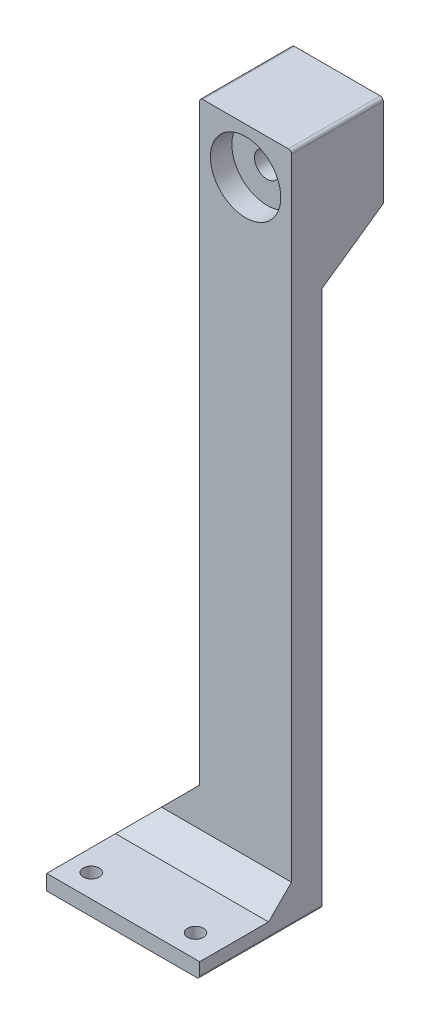
ISO-10303-21;
HEADER;
FILE_DESCRIPTION(('STEP AP214'),'2;1');
FILE_NAME('part.step','',(''),(''),'','','');
FILE_SCHEMA(('AUTOMOTIVE_DESIGN { 1 0 10303 214 1 1 1 1 }'));
ENDSEC;
DATA;
#1=APPLICATION_CONTEXT('core data for automotive mechanical design processes');
#2=APPLICATION_PROTOCOL_DEFINITION('international standard','automotive_design',2000,#1);
#3=PRODUCT_CONTEXT('',#1,'mechanical');
#4=PRODUCT('Part','Part','',(#3));
#5=PRODUCT_RELATED_PRODUCT_CATEGORY('part','',(#4));
#6=PRODUCT_DEFINITION_FORMATION('','',#4);
#7=PRODUCT_DEFINITION_CONTEXT('part definition',#1,'design');
#8=PRODUCT_DEFINITION('design','',#6,#7);
#9=PRODUCT_DEFINITION_SHAPE('','',#8);
#10=(LENGTH_UNIT() NAMED_UNIT(*) SI_UNIT(.MILLI.,.METRE.));
#11=(NAMED_UNIT(*) PLANE_ANGLE_UNIT() SI_UNIT($,.RADIAN.));
#12=(NAMED_UNIT(*) SI_UNIT($,.STERADIAN.) SOLID_ANGLE_UNIT());
#13=UNCERTAINTY_MEASURE_WITH_UNIT(LENGTH_MEASURE(1.E-05),#10,'distance_accuracy_value','');
#14=(GEOMETRIC_REPRESENTATION_CONTEXT(3) GLOBAL_UNCERTAINTY_ASSIGNED_CONTEXT((#13)) GLOBAL_UNIT_ASSIGNED_CONTEXT((#10,
#11,#12)) REPRESENTATION_CONTEXT('',''));
#15=CARTESIAN_POINT('',(0.,0.,0.));
#16=DIRECTION('',(0.,0.,1.));
#17=DIRECTION('',(1.,0.,0.));
#18=AXIS2_PLACEMENT_3D('',#15,#16,#17);
#19=CARTESIAN_POINT('',(0.,0.,-13.));
#20=DIRECTION('',(0.,0.,-1.));
#21=DIRECTION('',(-1.,0.,0.));
#22=AXIS2_PLACEMENT_3D('',#19,#20,#21);
#23=PLANE('',#22);
#24=CARTESIAN_POINT('',(522.434015224389,204.575071585759,-13.));
#25=DIRECTION('',(0.,0.,-1.));
#26=DIRECTION('',(-1.,0.,0.));
#27=AXIS2_PLACEMENT_3D('',#24,#25,#26);
#28=CIRCLE('',#27,4.10000000000005);
#29=CARTESIAN_POINT('',(518.334015224389,204.575071585759,-13.));
#30=VERTEX_POINT('',#29);
#31=EDGE_CURVE('E171',#30,#30,#28,.T.);
#32=ORIENTED_EDGE('',*,*,#31,.F.);
#33=EDGE_LOOP('',(#32));
#34=FACE_BOUND('',#33,.T.);
#35=CARTESIAN_POINT('',(522.434015224389,204.575071585759,-13.));
#36=DIRECTION('',(0.,0.,-1.));
#37=DIRECTION('',(-1.,0.,0.));
#38=AXIS2_PLACEMENT_3D('',#35,#36,#37);
#39=CIRCLE('',#38,11.4);
#40=CARTESIAN_POINT('',(511.034015224389,204.575071585759,-13.));
#41=VERTEX_POINT('',#40);
#42=EDGE_CURVE('E246',#41,#41,#39,.F.);
#43=ORIENTED_EDGE('',*,*,#42,.F.);
#44=EDGE_LOOP('',(#43));
#45=FACE_BOUND('',#44,.T.);
#46=ADVANCED_FACE('F37',(#34,#45),#23,.T.);
#47=CARTESIAN_POINT('',(0.,0.,0.));
#48=DIRECTION('',(0.,0.,1.));
#49=DIRECTION('',(1.,0.,0.));
#50=AXIS2_PLACEMENT_3D('',#47,#48,#49);
#51=PLANE('',#50);
#52=DIRECTION('',(0.,1.,0.));
#53=VECTOR('',#52,1.);
#54=CARTESIAN_POINT('',(537.434015224388,195.609984423857,0.));
#55=LINE('',#54,#53);
#56=CARTESIAN_POINT('',(537.434015224388,1.,0.));
#57=VERTEX_POINT('',#56);
#58=CARTESIAN_POINT('',(537.434015224388,175.570920821565,0.));
#59=VERTEX_POINT('',#58);
#60=EDGE_CURVE('E156',#57,#59,#55,.T.);
#61=ORIENTED_EDGE('',*,*,#60,.F.);
#62=CARTESIAN_POINT('',(536.434015224388,1.,0.));
#63=DIRECTION('',(0.,0.,1.));
#64=DIRECTION('',(1.,0.,0.));
#65=AXIS2_PLACEMENT_3D('',#62,#63,#64);
#66=CIRCLE('',#65,1.);
#67=CARTESIAN_POINT('',(536.434015224388,0.,0.));
#68=VERTEX_POINT('',#67);
#69=EDGE_CURVE('E257',#57,#68,#66,.F.);
#70=ORIENTED_EDGE('',*,*,#69,.T.);
#71=DIRECTION('',(1.,0.,0.));
#72=VECTOR('',#71,1.);
#73=CARTESIAN_POINT('',(507.43401522439,0.,0.));
#74=LINE('',#73,#72);
#75=CARTESIAN_POINT('',(487.43401522439,0.,0.));
#76=VERTEX_POINT('',#75);
#77=EDGE_CURVE('E225',#76,#68,#74,.T.);
#78=ORIENTED_EDGE('',*,*,#77,.F.);
#79=DIRECTION('',(0.,-1.,0.));
#80=VECTOR('',#79,1.);
#81=CARTESIAN_POINT('',(487.43401522439,0.,0.));
#82=LINE('',#81,#80);
#83=CARTESIAN_POINT('',(487.43401522439,5.,0.));
#84=VERTEX_POINT('',#83);
#85=EDGE_CURVE('E204',#84,#76,#82,.T.);
#86=ORIENTED_EDGE('',*,*,#85,.F.);
#87=DIRECTION('',(0.707106781186542,0.707106781186553,0.));
#88=VECTOR('',#87,1.);
#89=CARTESIAN_POINT('',(241.217007612199,-241.217007612195,0.));
#90=LINE('',#89,#88);
#91=CARTESIAN_POINT('',(507.43401522439,24.9999999999999,0.));
#92=VERTEX_POINT('',#91);
#93=EDGE_CURVE('E234',#84,#92,#90,.T.);
#94=ORIENTED_EDGE('',*,*,#93,.T.);
#95=DIRECTION('',(0.,-1.,0.));
#96=VECTOR('',#95,1.);
#97=CARTESIAN_POINT('',(507.434015224387,184.69087739587,0.));
#98=LINE('',#97,#96);
#99=CARTESIAN_POINT('',(507.434015224388,175.570920821565,0.));
#100=VERTEX_POINT('',#99);
#101=EDGE_CURVE('E210',#100,#92,#98,.T.);
#102=ORIENTED_EDGE('',*,*,#101,.F.);
#103=DIRECTION('',(1.,0.,0.));
#104=VECTOR('',#103,1.);
#105=CARTESIAN_POINT('',(537.434015224388,175.570920821565,0.));
#106=LINE('',#105,#104);
#107=EDGE_CURVE('E251',#100,#59,#106,.T.);
#108=ORIENTED_EDGE('',*,*,#107,.T.);
#109=EDGE_LOOP('',(#61,#70,#78,#86,#94,#102,#108));
#110=FACE_BOUND('',#109,.T.);
#111=ADVANCED_FACE('F307',(#110),#51,.F.);
#112=CARTESIAN_POINT('',(522.434015224389,204.575071585759,10.));
#113=DIRECTION('',(0.,0.,-1.));
#114=DIRECTION('',(-1.,0.,0.));
#115=AXIS2_PLACEMENT_3D('',#112,#113,#114);
#116=CYLINDRICAL_SURFACE('',#115,4.10000000000004);
#117=CARTESIAN_POINT('',(522.434015224389,204.575071585759,3.));
#118=DIRECTION('',(0.,0.,1.));
#119=DIRECTION('',(1.,0.,0.));
#120=AXIS2_PLACEMENT_3D('',#117,#118,#119);
#121=CIRCLE('',#120,4.10000000000004);
#122=CARTESIAN_POINT('',(526.534015224389,204.575071585759,3.));
#123=VERTEX_POINT('',#122);
#124=EDGE_CURVE('E178',#123,#123,#121,.T.);
#125=ORIENTED_EDGE('',*,*,#124,.T.);
#126=EDGE_LOOP('',(#125));
#127=FACE_BOUND('',#126,.T.);
#128=ORIENTED_EDGE('',*,*,#31,.T.);
#129=EDGE_LOOP('',(#128));
#130=FACE_BOUND('',#129,.T.);
#131=ADVANCED_FACE('F323',(#127,#130),#116,.F.);
#132=CARTESIAN_POINT('',(0.,0.,10.));
#133=DIRECTION('',(0.,0.,1.));
#134=DIRECTION('',(1.,0.,0.));
#135=AXIS2_PLACEMENT_3D('',#132,#133,#134);
#136=PLANE('',#135);
#137=CARTESIAN_POINT('',(522.434015224389,204.575071585759,10.));
#138=DIRECTION('',(0.,0.,1.));
#139=DIRECTION('',(1.,0.,0.));
#140=AXIS2_PLACEMENT_3D('',#137,#138,#139);
#141=CIRCLE('',#140,11.4999999999999);
#142=CARTESIAN_POINT('',(533.934015224389,204.575071585759,10.));
#143=VERTEX_POINT('',#142);
#144=EDGE_CURVE('E174',#143,#143,#141,.T.);
#145=ORIENTED_EDGE('',*,*,#144,.F.);
#146=EDGE_LOOP('',(#145));
#147=FACE_BOUND('',#146,.T.);
#148=DIRECTION('',(0.,1.,0.));
#149=VECTOR('',#148,1.);
#150=CARTESIAN_POINT('',(537.434015224388,195.609984423857,10.));
#151=LINE('',#150,#149);
#152=CARTESIAN_POINT('',(537.434015224388,12.5,10.));
#153=VERTEX_POINT('',#152);
#154=CARTESIAN_POINT('',(537.434015224388,218.57507158576,10.));
#155=VERTEX_POINT('',#154);
#156=EDGE_CURVE('E216',#153,#155,#151,.T.);
#157=ORIENTED_EDGE('',*,*,#156,.T.);
#158=CARTESIAN_POINT('',(536.434015224388,218.57507158576,10.));
#159=DIRECTION('',(0.,0.,1.));
#160=DIRECTION('',(1.,0.,0.));
#161=AXIS2_PLACEMENT_3D('',#158,#159,#160);
#162=CIRCLE('',#161,1.);
#163=CARTESIAN_POINT('',(536.434015224388,219.57507158576,10.));
#164=VERTEX_POINT('',#163);
#165=EDGE_CURVE('E45',#155,#164,#162,.T.);
#166=ORIENTED_EDGE('',*,*,#165,.T.);
#167=DIRECTION('',(-1.,0.,0.));
#168=VECTOR('',#167,1.);
#169=CARTESIAN_POINT('',(537.434015224388,219.57507158576,10.));
#170=LINE('',#169,#168);
#171=CARTESIAN_POINT('',(508.434015224387,219.57507158576,10.));
#172=VERTEX_POINT('',#171);
#173=EDGE_CURVE('E219',#164,#172,#170,.T.);
#174=ORIENTED_EDGE('',*,*,#173,.T.);
#175=CARTESIAN_POINT('',(508.434015224387,218.57507158576,10.));
#176=DIRECTION('',(0.,0.,1.));
#177=DIRECTION('',(1.,0.,0.));
#178=AXIS2_PLACEMENT_3D('',#175,#176,#177);
#179=CIRCLE('',#178,1.);
#180=CARTESIAN_POINT('',(507.434015224387,218.57507158576,10.));
#181=VERTEX_POINT('',#180);
#182=EDGE_CURVE('E52',#172,#181,#179,.T.);
#183=ORIENTED_EDGE('',*,*,#182,.T.);
#184=DIRECTION('',(0.,-1.,0.));
#185=VECTOR('',#184,1.);
#186=CARTESIAN_POINT('',(507.434015224387,219.57507158576,10.));
#187=LINE('',#186,#185);
#188=CARTESIAN_POINT('',(507.434015224387,24.9999999999999,10.));
#189=VERTEX_POINT('',#188);
#190=EDGE_CURVE('E221',#181,#189,#187,.T.);
#191=ORIENTED_EDGE('',*,*,#190,.T.);
#192=DIRECTION('',(-0.707106781186542,-0.707106781186553,0.));
#193=VECTOR('',#192,1.);
#194=CARTESIAN_POINT('',(507.43401522439,25.,10.));
#195=LINE('',#194,#193);
#196=CARTESIAN_POINT('',(494.93401522439,12.4999999999999,10.));
#197=VERTEX_POINT('',#196);
#198=EDGE_CURVE('E231',#189,#197,#195,.T.);
#199=ORIENTED_EDGE('',*,*,#198,.T.);
#200=DIRECTION('',(1.,0.,0.));
#201=VECTOR('',#200,1.);
#202=CARTESIAN_POINT('',(537.434015224388,12.5,10.));
#203=LINE('',#202,#201);
#204=EDGE_CURVE('E240',#197,#153,#203,.T.);
#205=ORIENTED_EDGE('',*,*,#204,.T.);
#206=EDGE_LOOP('',(#157,#166,#174,#183,#191,#199,#205));
#207=FACE_BOUND('',#206,.T.);
#208=ADVANCED_FACE('F272',(#147,#207),#136,.T.);
#209=CARTESIAN_POINT('',(537.434015224388,219.57507158576,10.));
#210=DIRECTION('',(0.,-1.,0.));
#211=DIRECTION('',(0.,0.,-1.));
#212=AXIS2_PLACEMENT_3D('',#209,#210,#211);
#213=PLANE('',#212);
#214=ORIENTED_EDGE('',*,*,#173,.F.);
#215=DIRECTION('',(0.,0.,-1.));
#216=VECTOR('',#215,1.);
#217=CARTESIAN_POINT('',(536.434015224388,219.57507158576,10.));
#218=LINE('',#217,#216);
#219=CARTESIAN_POINT('',(536.434015224388,219.57507158576,-20.));
#220=VERTEX_POINT('',#219);
#221=EDGE_CURVE('E265',#164,#220,#218,.T.);
#222=ORIENTED_EDGE('',*,*,#221,.T.);
#223=DIRECTION('',(1.,0.,0.));
#224=VECTOR('',#223,1.);
#225=CARTESIAN_POINT('',(537.434015224388,219.57507158576,-20.));
#226=LINE('',#225,#224);
#227=CARTESIAN_POINT('',(508.434015224387,219.57507158576,-20.));
#228=VERTEX_POINT('',#227);
#229=EDGE_CURVE('E166',#228,#220,#226,.T.);
#230=ORIENTED_EDGE('',*,*,#229,.F.);
#231=DIRECTION('',(0.,0.,-1.));
#232=VECTOR('',#231,1.);
#233=CARTESIAN_POINT('',(508.434015224387,219.57507158576,10.));
#234=LINE('',#233,#232);
#235=EDGE_CURVE('E263',#228,#172,#234,.F.);
#236=ORIENTED_EDGE('',*,*,#235,.T.);
#237=EDGE_LOOP('',(#214,#222,#230,#236));
#238=FACE_BOUND('',#237,.T.);
#239=ADVANCED_FACE('F277',(#238),#213,.F.);
#240=CARTESIAN_POINT('',(507.434015224387,184.69087739587,10.));
#241=DIRECTION('',(1.,0.,0.));
#242=DIRECTION('',(0.,1.,0.));
#243=AXIS2_PLACEMENT_3D('',#240,#241,#242);
#244=PLANE('',#243);
#245=ORIENTED_EDGE('',*,*,#190,.F.);
#246=DIRECTION('',(0.,0.,-1.));
#247=VECTOR('',#246,1.);
#248=CARTESIAN_POINT('',(507.434015224387,218.57507158576,10.));
#249=LINE('',#248,#247);
#250=CARTESIAN_POINT('',(507.434015224388,218.57507158576,-20.));
#251=VERTEX_POINT('',#250);
#252=EDGE_CURVE('E11',#181,#251,#249,.T.);
#253=ORIENTED_EDGE('',*,*,#252,.T.);
#254=DIRECTION('',(0.,1.,0.));
#255=VECTOR('',#254,1.);
#256=CARTESIAN_POINT('',(507.434015224388,219.57507158576,-20.));
#257=LINE('',#256,#255);
#258=CARTESIAN_POINT('',(507.434015224387,189.57507158576,-20.));
#259=VERTEX_POINT('',#258);
#260=EDGE_CURVE('E164',#259,#251,#257,.T.);
#261=ORIENTED_EDGE('',*,*,#260,.F.);
#262=DIRECTION('',(0.,0.573576436351051,-0.819152044288989));
#263=VECTOR('',#262,1.);
#264=CARTESIAN_POINT('',(507.434015224388,173.872831577454,2.42512276924731));
#265=LINE('',#264,#263);
#266=EDGE_CURVE('E161',#259,#100,#265,.F.);
#267=ORIENTED_EDGE('',*,*,#266,.T.);
#268=ORIENTED_EDGE('',*,*,#101,.T.);
#269=DIRECTION('',(0.,0.,1.));
#270=VECTOR('',#269,1.);
#271=CARTESIAN_POINT('',(507.43401522439,24.9999999999999,10.));
#272=LINE('',#271,#270);
#273=EDGE_CURVE('E223',#92,#189,#272,.T.);
#274=ORIENTED_EDGE('',*,*,#273,.T.);
#275=EDGE_LOOP('',(#245,#253,#261,#267,#268,#274));
#276=FACE_BOUND('',#275,.T.);
#277=ADVANCED_FACE('F312',(#276),#244,.F.);
#278=CARTESIAN_POINT('',(507.43401522439,0.,10.));
#279=DIRECTION('',(0.,1.,0.));
#280=DIRECTION('',(-1.,0.,0.));
#281=AXIS2_PLACEMENT_3D('',#278,#279,#280);
#282=PLANE('',#281);
#283=CARTESIAN_POINT('',(528.574793847968,0.,32.5));
#284=DIRECTION('',(0.,1.,0.));
#285=DIRECTION('',(-1.,0.,0.));
#286=AXIS2_PLACEMENT_3D('',#283,#284,#285);
#287=CIRCLE('',#286,2.60000000000007);
#288=CARTESIAN_POINT('',(525.974793847968,0.,32.5));
#289=VERTEX_POINT('',#288);
#290=EDGE_CURVE('E190',#289,#289,#287,.T.);
#291=ORIENTED_EDGE('',*,*,#290,.T.);
#292=EDGE_LOOP('',(#291));
#293=FACE_BOUND('',#292,.T.);
#294=CARTESIAN_POINT('',(494.48401522439,0.,32.5));
#295=DIRECTION('',(0.,1.,0.));
#296=DIRECTION('',(-1.,0.,0.));
#297=AXIS2_PLACEMENT_3D('',#294,#295,#296);
#298=CIRCLE('',#297,2.60000000000002);
#299=CARTESIAN_POINT('',(491.88401522439,0.,32.5));
#300=VERTEX_POINT('',#299);
#301=EDGE_CURVE('E184',#300,#300,#298,.T.);
#302=ORIENTED_EDGE('',*,*,#301,.T.);
#303=EDGE_LOOP('',(#302));
#304=FACE_BOUND('',#303,.T.);
#305=ORIENTED_EDGE('',*,*,#77,.T.);
#306=DIRECTION('',(0.,0.,-1.));
#307=VECTOR('',#306,1.);
#308=CARTESIAN_POINT('',(536.434015224388,0.,10.));
#309=LINE('',#308,#307);
#310=CARTESIAN_POINT('',(536.434015224388,0.,40.));
#311=VERTEX_POINT('',#310);
#312=EDGE_CURVE('E259',#68,#311,#309,.F.);
#313=ORIENTED_EDGE('',*,*,#312,.T.);
#314=DIRECTION('',(1.,0.,0.));
#315=VECTOR('',#314,1.);
#316=CARTESIAN_POINT('',(507.43401522439,0.,40.));
#317=LINE('',#316,#315);
#318=CARTESIAN_POINT('',(487.43401522439,0.,40.));
#319=VERTEX_POINT('',#318);
#320=EDGE_CURVE('E193',#319,#311,#317,.T.);
#321=ORIENTED_EDGE('',*,*,#320,.F.);
#322=DIRECTION('',(0.,0.,1.));
#323=VECTOR('',#322,1.);
#324=CARTESIAN_POINT('',(487.43401522439,0.,0.));
#325=LINE('',#324,#323);
#326=EDGE_CURVE('E208',#76,#319,#325,.T.);
#327=ORIENTED_EDGE('',*,*,#326,.F.);
#328=EDGE_LOOP('',(#305,#313,#321,#327));
#329=FACE_BOUND('',#328,.T.);
#330=ADVANCED_FACE('F301',(#293,#304,#329),#282,.F.);
#331=CARTESIAN_POINT('',(537.434015224388,195.609984423857,10.));
#332=DIRECTION('',(-1.,0.,0.));
#333=DIRECTION('',(0.,-1.,0.));
#334=AXIS2_PLACEMENT_3D('',#331,#332,#333);
#335=PLANE('',#334);
#336=DIRECTION('',(0.,1.,0.));
#337=VECTOR('',#336,1.);
#338=CARTESIAN_POINT('',(537.434015224388,0.,40.));
#339=LINE('',#338,#337);
#340=CARTESIAN_POINT('',(537.434015224388,1.,40.));
#341=VERTEX_POINT('',#340);
#342=CARTESIAN_POINT('',(537.434015224388,5.,40.));
#343=VERTEX_POINT('',#342);
#344=EDGE_CURVE('E196',#341,#343,#339,.T.);
#345=ORIENTED_EDGE('',*,*,#344,.F.);
#346=DIRECTION('',(0.,0.,-1.));
#347=VECTOR('',#346,1.);
#348=CARTESIAN_POINT('',(537.434015224388,1.,10.));
#349=LINE('',#348,#347);
#350=EDGE_CURVE('E255',#341,#57,#349,.T.);
#351=ORIENTED_EDGE('',*,*,#350,.T.);
#352=ORIENTED_EDGE('',*,*,#60,.T.);
#353=DIRECTION('',(0.,-0.573576436351051,0.819152044288989));
#354=VECTOR('',#353,1.);
#355=CARTESIAN_POINT('',(537.434015224388,177.465107816098,-2.70517938063804));
#356=LINE('',#355,#354);
#357=CARTESIAN_POINT('',(537.434015224388,189.57507158576,-20.));
#358=VERTEX_POINT('',#357);
#359=EDGE_CURVE('E151',#59,#358,#356,.F.);
#360=ORIENTED_EDGE('',*,*,#359,.T.);
#361=DIRECTION('',(0.,-1.,0.));
#362=VECTOR('',#361,1.);
#363=CARTESIAN_POINT('',(537.434015224388,219.57507158576,-20.));
#364=LINE('',#363,#362);
#365=CARTESIAN_POINT('',(537.434015224388,218.57507158576,-20.));
#366=VERTEX_POINT('',#365);
#367=EDGE_CURVE('E136',#366,#358,#364,.T.);
#368=ORIENTED_EDGE('',*,*,#367,.F.);
#369=DIRECTION('',(0.,0.,-1.));
#370=VECTOR('',#369,1.);
#371=CARTESIAN_POINT('',(537.434015224388,218.57507158576,10.));
#372=LINE('',#371,#370);
#373=EDGE_CURVE('E160',#366,#155,#372,.F.);
#374=ORIENTED_EDGE('',*,*,#373,.T.);
#375=ORIENTED_EDGE('',*,*,#156,.F.);
#376=DIRECTION('',(0.,0.707106781186544,-0.707106781186552));
#377=VECTOR('',#376,1.);
#378=CARTESIAN_POINT('',(537.434015224388,104.054992211927,-81.5549922119284));
#379=LINE('',#378,#377);
#380=CARTESIAN_POINT('',(537.434015224388,5.,17.5));
#381=VERTEX_POINT('',#380);
#382=EDGE_CURVE('E244',#153,#381,#379,.F.);
#383=ORIENTED_EDGE('',*,*,#382,.T.);
#384=DIRECTION('',(0.,0.,1.));
#385=VECTOR('',#384,1.);
#386=CARTESIAN_POINT('',(537.434015224388,5.,0.));
#387=LINE('',#386,#385);
#388=EDGE_CURVE('E207',#381,#343,#387,.T.);
#389=ORIENTED_EDGE('',*,*,#388,.T.);
#390=EDGE_LOOP('',(#345,#351,#352,#360,#368,#374,#375,#383,#389));
#391=FACE_BOUND('',#390,.T.);
#392=ADVANCED_FACE('F153',(#391),#335,.F.);
#393=CARTESIAN_POINT('',(487.43401522439,0.,0.));
#394=DIRECTION('',(-1.,0.,0.));
#395=DIRECTION('',(0.,0.,1.));
#396=AXIS2_PLACEMENT_3D('',#393,#394,#395);
#397=PLANE('',#396);
#398=ORIENTED_EDGE('',*,*,#326,.T.);
#399=DIRECTION('',(0.,-1.,0.));
#400=VECTOR('',#399,1.);
#401=CARTESIAN_POINT('',(487.43401522439,0.,40.));
#402=LINE('',#401,#400);
#403=CARTESIAN_POINT('',(487.43401522439,5.,40.));
#404=VERTEX_POINT('',#403);
#405=EDGE_CURVE('E201',#404,#319,#402,.T.);
#406=ORIENTED_EDGE('',*,*,#405,.F.);
#407=DIRECTION('',(0.,0.,1.));
#408=VECTOR('',#407,1.);
#409=CARTESIAN_POINT('',(487.43401522439,5.,0.));
#410=LINE('',#409,#408);
#411=CARTESIAN_POINT('',(487.43401522439,5.,17.5));
#412=VERTEX_POINT('',#411);
#413=EDGE_CURVE('E213',#412,#404,#410,.T.);
#414=ORIENTED_EDGE('',*,*,#413,.F.);
#415=EDGE_CURVE('E211',#84,#412,#410,.T.);
#416=ORIENTED_EDGE('',*,*,#415,.F.);
#417=ORIENTED_EDGE('',*,*,#85,.T.);
#418=EDGE_LOOP('',(#398,#406,#414,#416,#417));
#419=FACE_BOUND('',#418,.T.);
#420=ADVANCED_FACE('F293',(#419),#397,.T.);
#421=CARTESIAN_POINT('',(487.43401522439,5.,0.));
#422=DIRECTION('',(0.,1.,0.));
#423=DIRECTION('',(0.,0.,1.));
#424=AXIS2_PLACEMENT_3D('',#421,#422,#423);
#425=PLANE('',#424);
#426=CARTESIAN_POINT('',(528.574793847968,5.,32.5));
#427=DIRECTION('',(0.,1.,0.));
#428=DIRECTION('',(0.,0.,1.));
#429=AXIS2_PLACEMENT_3D('',#426,#427,#428);
#430=CIRCLE('',#429,2.60000000000007);
#431=CARTESIAN_POINT('',(528.574793847968,5.,35.1000000000001));
#432=VERTEX_POINT('',#431);
#433=EDGE_CURVE('E181',#432,#432,#430,.T.);
#434=ORIENTED_EDGE('',*,*,#433,.F.);
#435=EDGE_LOOP('',(#434));
#436=FACE_BOUND('',#435,.T.);
#437=CARTESIAN_POINT('',(494.48401522439,5.,32.5));
#438=DIRECTION('',(0.,1.,0.));
#439=DIRECTION('',(0.,0.,1.));
#440=AXIS2_PLACEMENT_3D('',#437,#438,#439);
#441=CIRCLE('',#440,2.60000000000002);
#442=CARTESIAN_POINT('',(494.48401522439,5.,35.1));
#443=VERTEX_POINT('',#442);
#444=EDGE_CURVE('E185',#443,#443,#441,.T.);
#445=ORIENTED_EDGE('',*,*,#444,.F.);
#446=EDGE_LOOP('',(#445));
#447=FACE_BOUND('',#446,.T.);
#448=ORIENTED_EDGE('',*,*,#388,.F.);
#449=DIRECTION('',(-1.,0.,0.));
#450=VECTOR('',#449,1.);
#451=CARTESIAN_POINT('',(487.43401522439,5.,17.5));
#452=LINE('',#451,#450);
#453=EDGE_CURVE('E237',#381,#412,#452,.T.);
#454=ORIENTED_EDGE('',*,*,#453,.T.);
#455=ORIENTED_EDGE('',*,*,#413,.T.);
#456=DIRECTION('',(-1.,0.,0.));
#457=VECTOR('',#456,1.);
#458=CARTESIAN_POINT('',(507.43401522439,5.,40.));
#459=LINE('',#458,#457);
#460=EDGE_CURVE('E198',#343,#404,#459,.T.);
#461=ORIENTED_EDGE('',*,*,#460,.F.);
#462=EDGE_LOOP('',(#448,#454,#455,#461));
#463=FACE_BOUND('',#462,.T.);
#464=ADVANCED_FACE('F289',(#436,#447,#463),#425,.T.);
#465=CARTESIAN_POINT('',(0.,0.,40.));
#466=DIRECTION('',(0.,0.,-1.));
#467=DIRECTION('',(-1.,0.,0.));
#468=AXIS2_PLACEMENT_3D('',#465,#466,#467);
#469=PLANE('',#468);
#470=ORIENTED_EDGE('',*,*,#320,.T.);
#471=CARTESIAN_POINT('',(536.434015224388,1.,40.));
#472=DIRECTION('',(0.,0.,-1.));
#473=DIRECTION('',(-1.,0.,0.));
#474=AXIS2_PLACEMENT_3D('',#471,#472,#473);
#475=CIRCLE('',#474,1.);
#476=EDGE_CURVE('E261',#311,#341,#475,.F.);
#477=ORIENTED_EDGE('',*,*,#476,.T.);
#478=ORIENTED_EDGE('',*,*,#344,.T.);
#479=ORIENTED_EDGE('',*,*,#460,.T.);
#480=ORIENTED_EDGE('',*,*,#405,.T.);
#481=EDGE_LOOP('',(#470,#477,#478,#479,#480));
#482=FACE_BOUND('',#481,.T.);
#483=ADVANCED_FACE('F298',(#482),#469,.F.);
#484=CARTESIAN_POINT('',(494.48401522439,-15.,32.5));
#485=DIRECTION('',(0.,1.,0.));
#486=DIRECTION('',(0.,0.,1.));
#487=AXIS2_PLACEMENT_3D('',#484,#485,#486);
#488=CYLINDRICAL_SURFACE('',#487,2.60000000000002);
#489=ORIENTED_EDGE('',*,*,#444,.T.);
#490=EDGE_LOOP('',(#489));
#491=FACE_BOUND('',#490,.T.);
#492=ORIENTED_EDGE('',*,*,#301,.F.);
#493=EDGE_LOOP('',(#492));
#494=FACE_BOUND('',#493,.T.);
#495=ADVANCED_FACE('F342',(#491,#494),#488,.F.);
#496=CARTESIAN_POINT('',(528.574793847968,-15.,32.5));
#497=DIRECTION('',(0.,1.,0.));
#498=DIRECTION('',(0.,0.,1.));
#499=AXIS2_PLACEMENT_3D('',#496,#497,#498);
#500=CYLINDRICAL_SURFACE('',#499,2.60000000000007);
#501=ORIENTED_EDGE('',*,*,#433,.T.);
#502=EDGE_LOOP('',(#501));
#503=FACE_BOUND('',#502,.T.);
#504=ORIENTED_EDGE('',*,*,#290,.F.);
#505=EDGE_LOOP('',(#504));
#506=FACE_BOUND('',#505,.T.);
#507=ADVANCED_FACE('F338',(#503,#506),#500,.F.);
#508=CARTESIAN_POINT('',(507.43401522439,25.,10.));
#509=DIRECTION('',(0.707106781186553,-0.707106781186542,0.));
#510=DIRECTION('',(0.,0.,1.));
#511=AXIS2_PLACEMENT_3D('',#508,#509,#510);
#512=PLANE('',#511);
#513=ORIENTED_EDGE('',*,*,#93,.F.);
#514=ORIENTED_EDGE('',*,*,#415,.T.);
#515=DIRECTION('',(-0.577350269189618,-0.577350269189626,0.577350269189633));
#516=VECTOR('',#515,1.);
#517=CARTESIAN_POINT('',(503.267348557723,20.8333333333332,1.66666666666667));
#518=LINE('',#517,#516);
#519=EDGE_CURVE('E242',#412,#197,#518,.F.);
#520=ORIENTED_EDGE('',*,*,#519,.T.);
#521=ORIENTED_EDGE('',*,*,#198,.F.);
#522=ORIENTED_EDGE('',*,*,#273,.F.);
#523=EDGE_LOOP('',(#513,#514,#520,#521,#522));
#524=FACE_BOUND('',#523,.T.);
#525=ADVANCED_FACE('F341',(#524),#512,.F.);
#526=CARTESIAN_POINT('',(487.43401522439,5.,17.5));
#527=DIRECTION('',(0.,0.707106781186552,0.707106781186544));
#528=DIRECTION('',(1.,0.,0.));
#529=AXIS2_PLACEMENT_3D('',#526,#527,#528);
#530=PLANE('',#529);
#531=ORIENTED_EDGE('',*,*,#382,.F.);
#532=ORIENTED_EDGE('',*,*,#204,.F.);
#533=ORIENTED_EDGE('',*,*,#519,.F.);
#534=ORIENTED_EDGE('',*,*,#453,.F.);
#535=EDGE_LOOP('',(#531,#532,#533,#534));
#536=FACE_BOUND('',#535,.T.);
#537=ADVANCED_FACE('F285',(#536),#530,.T.);
#538=CARTESIAN_POINT('',(522.434015224389,204.575071585759,3.));
#539=DIRECTION('',(0.,0.,1.));
#540=DIRECTION('',(1.,0.,0.));
#541=AXIS2_PLACEMENT_3D('',#538,#539,#540);
#542=CYLINDRICAL_SURFACE('',#541,11.4999999999999);
#543=CARTESIAN_POINT('',(522.434015224389,204.575071585759,3.));
#544=DIRECTION('',(0.,0.,1.));
#545=DIRECTION('',(1.,0.,0.));
#546=AXIS2_PLACEMENT_3D('',#543,#544,#545);
#547=CIRCLE('',#546,11.4999999999999);
#548=CARTESIAN_POINT('',(533.934015224389,204.575071585759,3.));
#549=VERTEX_POINT('',#548);
#550=EDGE_CURVE('E175',#549,#549,#547,.T.);
#551=ORIENTED_EDGE('',*,*,#550,.F.);
#552=EDGE_LOOP('',(#551));
#553=FACE_BOUND('',#552,.T.);
#554=ORIENTED_EDGE('',*,*,#144,.T.);
#555=EDGE_LOOP('',(#554));
#556=FACE_BOUND('',#555,.T.);
#557=ADVANCED_FACE('F333',(#553,#556),#542,.F.);
#558=CARTESIAN_POINT('',(522.434015224389,204.575071585759,3.));
#559=DIRECTION('',(0.,0.,1.));
#560=DIRECTION('',(1.,0.,0.));
#561=AXIS2_PLACEMENT_3D('',#558,#559,#560);
#562=PLANE('',#561);
#563=ORIENTED_EDGE('',*,*,#124,.F.);
#564=EDGE_LOOP('',(#563));
#565=FACE_BOUND('',#564,.T.);
#566=ORIENTED_EDGE('',*,*,#550,.T.);
#567=EDGE_LOOP('',(#566));
#568=FACE_BOUND('',#567,.T.);
#569=ADVANCED_FACE('F330',(#565,#568),#562,.T.);
#570=CARTESIAN_POINT('',(0.,0.,-20.));
#571=DIRECTION('',(0.,0.,-1.));
#572=DIRECTION('',(-1.,0.,0.));
#573=AXIS2_PLACEMENT_3D('',#570,#571,#572);
#574=PLANE('',#573);
#575=ORIENTED_EDGE('',*,*,#229,.T.);
#576=CARTESIAN_POINT('',(536.434015224388,218.57507158576,-20.));
#577=DIRECTION('',(0.,0.,-1.));
#578=DIRECTION('',(-1.,0.,0.));
#579=AXIS2_PLACEMENT_3D('',#576,#577,#578);
#580=CIRCLE('',#579,1.);
#581=EDGE_CURVE('E145',#220,#366,#580,.T.);
#582=ORIENTED_EDGE('',*,*,#581,.T.);
#583=ORIENTED_EDGE('',*,*,#367,.T.);
#584=DIRECTION('',(-1.,0.,0.));
#585=VECTOR('',#584,1.);
#586=CARTESIAN_POINT('',(537.434015224388,189.57507158576,-20.));
#587=LINE('',#586,#585);
#588=EDGE_CURVE('E143',#358,#259,#587,.T.);
#589=ORIENTED_EDGE('',*,*,#588,.T.);
#590=ORIENTED_EDGE('',*,*,#260,.T.);
#591=CARTESIAN_POINT('',(508.434015224387,218.57507158576,-20.));
#592=DIRECTION('',(0.,0.,-1.));
#593=DIRECTION('',(-1.,0.,0.));
#594=AXIS2_PLACEMENT_3D('',#591,#592,#593);
#595=CIRCLE('',#594,1.);
#596=EDGE_CURVE('E60',#251,#228,#595,.T.);
#597=ORIENTED_EDGE('',*,*,#596,.T.);
#598=EDGE_LOOP('',(#575,#582,#583,#589,#590,#597));
#599=FACE_BOUND('',#598,.T.);
#600=CARTESIAN_POINT('',(522.434015224389,204.575071585759,-20.));
#601=DIRECTION('',(0.,0.,-1.));
#602=DIRECTION('',(-1.,0.,0.));
#603=AXIS2_PLACEMENT_3D('',#600,#601,#602);
#604=CIRCLE('',#603,11.4);
#605=CARTESIAN_POINT('',(511.034015224389,204.575071585759,-20.));
#606=VERTEX_POINT('',#605);
#607=EDGE_CURVE('E148',#606,#606,#604,.T.);
#608=ORIENTED_EDGE('',*,*,#607,.F.);
#609=EDGE_LOOP('',(#608));
#610=FACE_BOUND('',#609,.T.);
#611=ADVANCED_FACE('F139',(#599,#610),#574,.T.);
#612=CARTESIAN_POINT('',(522.434015224389,204.575071585759,-20.));
#613=DIRECTION('',(0.,0.,1.));
#614=DIRECTION('',(1.,0.,0.));
#615=AXIS2_PLACEMENT_3D('',#612,#613,#614);
#616=CYLINDRICAL_SURFACE('',#615,11.4);
#617=ORIENTED_EDGE('',*,*,#607,.T.);
#618=EDGE_LOOP('',(#617));
#619=FACE_BOUND('',#618,.T.);
#620=ORIENTED_EDGE('',*,*,#42,.T.);
#621=EDGE_LOOP('',(#620));
#622=FACE_BOUND('',#621,.T.);
#623=ADVANCED_FACE('F385',(#619,#622),#616,.F.);
#624=CARTESIAN_POINT('',(537.434015224388,189.57507158576,-19.9999999999999));
#625=DIRECTION('',(0.,-0.819152044288989,-0.57357643635105));
#626=DIRECTION('',(1.,0.,0.));
#627=AXIS2_PLACEMENT_3D('',#624,#625,#626);
#628=PLANE('',#627);
#629=ORIENTED_EDGE('',*,*,#359,.F.);
#630=ORIENTED_EDGE('',*,*,#107,.F.);
#631=ORIENTED_EDGE('',*,*,#266,.F.);
#632=ORIENTED_EDGE('',*,*,#588,.F.);
#633=EDGE_LOOP('',(#629,#630,#631,#632));
#634=FACE_BOUND('',#633,.T.);
#635=ADVANCED_FACE('F163',(#634),#628,.T.);
#636=CARTESIAN_POINT('',(536.434015224388,1.,10.));
#637=DIRECTION('',(0.,0.,-1.));
#638=DIRECTION('',(-1.,0.,0.));
#639=AXIS2_PLACEMENT_3D('',#636,#637,#638);
#640=CYLINDRICAL_SURFACE('',#639,1.);
#641=ORIENTED_EDGE('',*,*,#476,.F.);
#642=ORIENTED_EDGE('',*,*,#312,.F.);
#643=ORIENTED_EDGE('',*,*,#69,.F.);
#644=ORIENTED_EDGE('',*,*,#350,.F.);
#645=EDGE_LOOP('',(#641,#642,#643,#644));
#646=FACE_BOUND('',#645,.T.);
#647=ADVANCED_FACE('F304',(#646),#640,.T.);
#648=CARTESIAN_POINT('',(536.434015224388,218.57507158576,10.));
#649=DIRECTION('',(0.,0.,-1.));
#650=DIRECTION('',(-1.,0.,0.));
#651=AXIS2_PLACEMENT_3D('',#648,#649,#650);
#652=CYLINDRICAL_SURFACE('',#651,1.);
#653=ORIENTED_EDGE('',*,*,#165,.F.);
#654=ORIENTED_EDGE('',*,*,#373,.F.);
#655=ORIENTED_EDGE('',*,*,#581,.F.);
#656=ORIENTED_EDGE('',*,*,#221,.F.);
#657=EDGE_LOOP('',(#653,#654,#655,#656));
#658=FACE_BOUND('',#657,.T.);
#659=ADVANCED_FACE('F279',(#658),#652,.T.);
#660=CARTESIAN_POINT('',(508.434015224387,218.57507158576,10.));
#661=DIRECTION('',(0.,0.,-1.));
#662=DIRECTION('',(-1.,0.,0.));
#663=AXIS2_PLACEMENT_3D('',#660,#661,#662);
#664=CYLINDRICAL_SURFACE('',#663,1.);
#665=ORIENTED_EDGE('',*,*,#182,.F.);
#666=ORIENTED_EDGE('',*,*,#235,.F.);
#667=ORIENTED_EDGE('',*,*,#596,.F.);
#668=ORIENTED_EDGE('',*,*,#252,.F.);
#669=EDGE_LOOP('',(#665,#666,#667,#668));
#670=FACE_BOUND('',#669,.T.);
#671=ADVANCED_FACE('F39',(#670),#664,.T.);
#672=CLOSED_SHELL('',(#46,#111,#131,#208,#239,#277,#330,#392,#420,#464,#483,#495,#507,#525,#537,
#557,#569,#611,#623,#635,#647,#659,#671));
#673=MANIFOLD_SOLID_BREP('B2',#672);
#674=ADVANCED_BREP_SHAPE_REPRESENTATION('',(#18,#673),#14);
#675=SHAPE_DEFINITION_REPRESENTATION(#9,#674);
ENDSEC;
END-ISO-10303-21;
